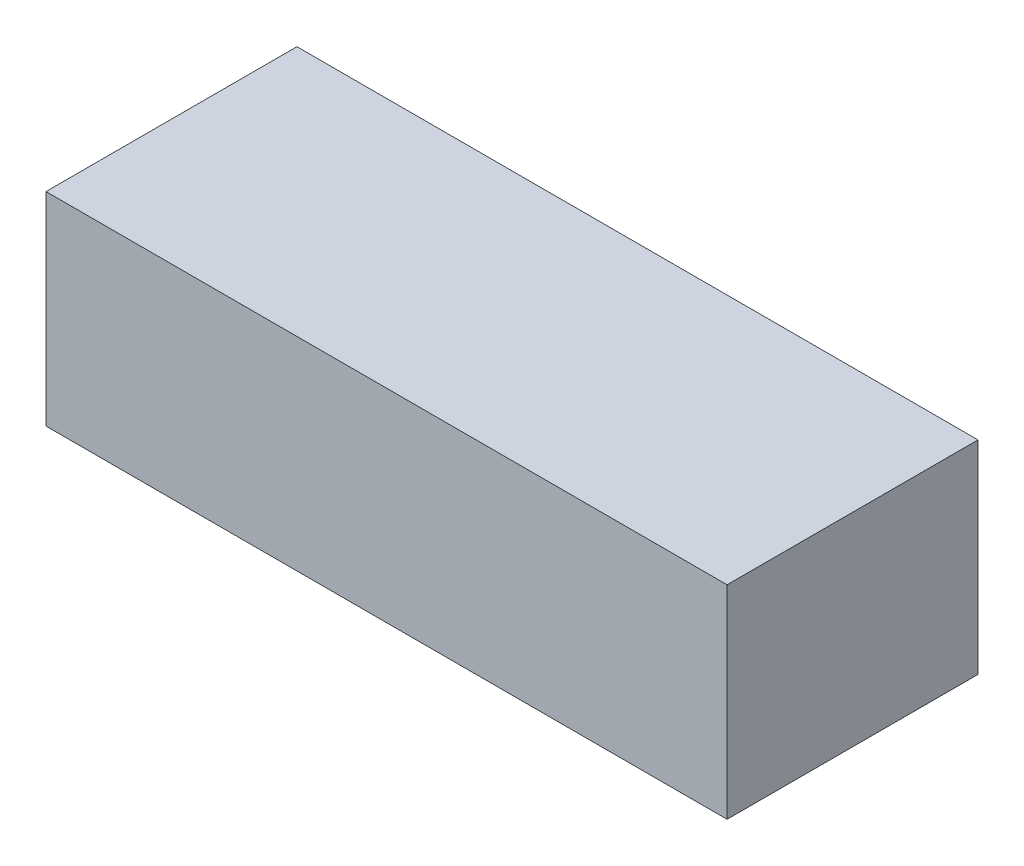
ISO-10303-21;
HEADER;
FILE_DESCRIPTION(('STEP AP214'),'2;1');
FILE_NAME('part.step','',(''),(''),'','','');
FILE_SCHEMA(('AUTOMOTIVE_DESIGN { 1 0 10303 214 1 1 1 1 }'));
ENDSEC;
DATA;
#1=APPLICATION_CONTEXT('core data for automotive mechanical design processes');
#2=APPLICATION_PROTOCOL_DEFINITION('international standard','automotive_design',2000,#1);
#3=PRODUCT_CONTEXT('',#1,'mechanical');
#4=PRODUCT('Part','Part','',(#3));
#5=PRODUCT_RELATED_PRODUCT_CATEGORY('part','',(#4));
#6=PRODUCT_DEFINITION_FORMATION('','',#4);
#7=PRODUCT_DEFINITION_CONTEXT('part definition',#1,'design');
#8=PRODUCT_DEFINITION('design','',#6,#7);
#9=PRODUCT_DEFINITION_SHAPE('','',#8);
#10=(LENGTH_UNIT() NAMED_UNIT(*) SI_UNIT(.MILLI.,.METRE.));
#11=(NAMED_UNIT(*) PLANE_ANGLE_UNIT() SI_UNIT($,.RADIAN.));
#12=(NAMED_UNIT(*) SI_UNIT($,.STERADIAN.) SOLID_ANGLE_UNIT());
#13=UNCERTAINTY_MEASURE_WITH_UNIT(LENGTH_MEASURE(1.E-05),#10,'distance_accuracy_value','');
#14=(GEOMETRIC_REPRESENTATION_CONTEXT(3) GLOBAL_UNCERTAINTY_ASSIGNED_CONTEXT((#13)) GLOBAL_UNIT_ASSIGNED_CONTEXT((#10,
#11,#12)) REPRESENTATION_CONTEXT('',''));
#15=CARTESIAN_POINT('',(0.,0.,0.));
#16=DIRECTION('',(0.,0.,1.));
#17=DIRECTION('',(1.,0.,0.));
#18=AXIS2_PLACEMENT_3D('',#15,#16,#17);
#19=CARTESIAN_POINT('',(0.,-8.00000037997961,0.));
#20=DIRECTION('',(0.,1.,0.));
#21=DIRECTION('',(0.,0.,1.));
#22=AXIS2_PLACEMENT_3D('',#19,#20,#21);
#23=PLANE('',#22);
#24=DIRECTION('',(0.,0.,1.));
#25=VECTOR('',#24,1.);
#26=CARTESIAN_POINT('',(45.0000017881393,-8.00000037997961,16.0000007599592));
#27=LINE('',#26,#25);
#28=CARTESIAN_POINT('',(45.0000017881393,-8.00000037997961,4.99999988824129));
#29=VERTEX_POINT('',#28);
#30=CARTESIAN_POINT('',(45.0000017881393,-8.00000037997961,16.0000007599592));
#31=VERTEX_POINT('',#30);
#32=EDGE_CURVE('E152',#29,#31,#27,.T.);
#33=ORIENTED_EDGE('',*,*,#32,.T.);
#34=DIRECTION('',(-1.,0.,0.));
#35=VECTOR('',#34,1.);
#36=CARTESIAN_POINT('',(-9.99999977648258,-8.00000037997961,16.0000007599592));
#37=LINE('',#36,#35);
#38=CARTESIAN_POINT('',(-9.99999977648258,-8.00000037997961,16.0000007599592));
#39=VERTEX_POINT('',#38);
#40=EDGE_CURVE('E155',#31,#39,#37,.T.);
#41=ORIENTED_EDGE('',*,*,#40,.T.);
#42=DIRECTION('',(0.,0.,-1.));
#43=VECTOR('',#42,1.);
#44=CARTESIAN_POINT('',(-9.99999977648258,-8.00000037997961,4.99999988824129));
#45=LINE('',#44,#43);
#46=CARTESIAN_POINT('',(-9.99999977648258,-8.00000037997961,4.99999988824129));
#47=VERTEX_POINT('',#46);
#48=EDGE_CURVE('E158',#39,#47,#45,.T.);
#49=ORIENTED_EDGE('',*,*,#48,.T.);
#50=DIRECTION('',(1.,0.,0.));
#51=VECTOR('',#50,1.);
#52=CARTESIAN_POINT('',(45.0000017881393,-8.00000037997961,4.99999988824129));
#53=LINE('',#52,#51);
#54=EDGE_CURVE('E160',#47,#29,#53,.T.);
#55=ORIENTED_EDGE('',*,*,#54,.T.);
#56=EDGE_LOOP('',(#33,#41,#49,#55));
#57=FACE_BOUND('',#56,.T.);
#58=DIRECTION('',(-1.,0.,0.));
#59=VECTOR('',#58,1.);
#60=CARTESIAN_POINT('',(-8.99999961256981,-8.00000037997961,13.0000002682209));
#61=LINE('',#60,#59);
#62=CARTESIAN_POINT('',(43.9999997615814,-8.00000037997961,13.0000002682209));
#63=VERTEX_POINT('',#62);
#64=CARTESIAN_POINT('',(-8.99999961256981,-8.00000037997961,13.0000002682209));
#65=VERTEX_POINT('',#64);
#66=EDGE_CURVE('E50',#63,#65,#61,.T.);
#67=ORIENTED_EDGE('',*,*,#66,.F.);
#68=DIRECTION('',(0.,0.,1.));
#69=VECTOR('',#68,1.);
#70=CARTESIAN_POINT('',(43.9999997615814,-8.00000037997961,13.0000002682209));
#71=LINE('',#70,#69);
#72=CARTESIAN_POINT('',(43.9999997615814,-8.00000037997961,9.99999977648258));
#73=VERTEX_POINT('',#72);
#74=EDGE_CURVE('E54',#73,#63,#71,.T.);
#75=ORIENTED_EDGE('',*,*,#74,.F.);
#76=DIRECTION('',(1.,0.,0.));
#77=VECTOR('',#76,1.);
#78=CARTESIAN_POINT('',(43.9999997615814,-8.00000037997961,9.99999977648258));
#79=LINE('',#78,#77);
#80=CARTESIAN_POINT('',(-8.99999961256981,-8.00000037997961,9.99999977648258));
#81=VERTEX_POINT('',#80);
#82=EDGE_CURVE('E368',#81,#73,#79,.T.);
#83=ORIENTED_EDGE('',*,*,#82,.F.);
#84=DIRECTION('',(0.,0.,-1.));
#85=VECTOR('',#84,1.);
#86=CARTESIAN_POINT('',(-8.99999961256981,-8.00000037997961,9.99999977648258));
#87=LINE('',#86,#85);
#88=EDGE_CURVE('E374',#65,#81,#87,.T.);
#89=ORIENTED_EDGE('',*,*,#88,.F.);
#90=EDGE_LOOP('',(#67,#75,#83,#89));
#91=FACE_BOUND('',#90,.T.);
#92=ADVANCED_FACE('F33',(#57,#91),#23,.F.);
#93=CARTESIAN_POINT('',(0.,-7.00000021606684,0.));
#94=DIRECTION('',(0.,1.,0.));
#95=DIRECTION('',(0.,0.,1.));
#96=AXIS2_PLACEMENT_3D('',#93,#94,#95);
#97=PLANE('',#96);
#98=DIRECTION('',(1.,0.,0.));
#99=VECTOR('',#98,1.);
#100=CARTESIAN_POINT('',(-10.9999999403954,-7.00000021606684,20.9999997168779));
#101=LINE('',#100,#99);
#102=CARTESIAN_POINT('',(-10.9999999403954,-7.00000021606684,20.9999997168779));
#103=VERTEX_POINT('',#102);
#104=CARTESIAN_POINT('',(46.000000089407,-7.00000021606684,20.9999997168779));
#105=VERTEX_POINT('',#104);
#106=EDGE_CURVE('E182',#103,#105,#101,.T.);
#107=ORIENTED_EDGE('',*,*,#106,.F.);
#108=DIRECTION('',(0.,0.,1.));
#109=VECTOR('',#108,1.);
#110=CARTESIAN_POINT('',(-10.9999999403954,-7.00000021606684,0.));
#111=LINE('',#110,#109);
#112=CARTESIAN_POINT('',(-10.9999999403954,-7.00000021606684,0.));
#113=VERTEX_POINT('',#112);
#114=EDGE_CURVE('E192',#113,#103,#111,.T.);
#115=ORIENTED_EDGE('',*,*,#114,.F.);
#116=DIRECTION('',(-1.,0.,0.));
#117=VECTOR('',#116,1.);
#118=CARTESIAN_POINT('',(46.000000089407,-7.00000021606684,0.));
#119=LINE('',#118,#117);
#120=CARTESIAN_POINT('',(46.000000089407,-7.00000021606684,0.));
#121=VERTEX_POINT('',#120);
#122=EDGE_CURVE('E189',#121,#113,#119,.T.);
#123=ORIENTED_EDGE('',*,*,#122,.F.);
#124=DIRECTION('',(0.,0.,-1.));
#125=VECTOR('',#124,1.);
#126=CARTESIAN_POINT('',(46.000000089407,-7.00000021606684,20.9999997168779));
#127=LINE('',#126,#125);
#128=EDGE_CURVE('E185',#105,#121,#127,.T.);
#129=ORIENTED_EDGE('',*,*,#128,.F.);
#130=EDGE_LOOP('',(#107,#115,#123,#129));
#131=FACE_BOUND('',#130,.T.);
#132=DIRECTION('',(0.,0.,1.));
#133=VECTOR('',#132,1.);
#134=CARTESIAN_POINT('',(45.0000017881393,-7.00000021606684,16.0000007599592));
#135=LINE('',#134,#133);
#136=CARTESIAN_POINT('',(45.0000017881393,-7.00000021606684,4.99999988824129));
#137=VERTEX_POINT('',#136);
#138=CARTESIAN_POINT('',(45.0000017881393,-7.00000021606684,16.0000007599592));
#139=VERTEX_POINT('',#138);
#140=EDGE_CURVE('E143',#137,#139,#135,.T.);
#141=ORIENTED_EDGE('',*,*,#140,.F.);
#142=DIRECTION('',(1.,0.,0.));
#143=VECTOR('',#142,1.);
#144=CARTESIAN_POINT('',(45.0000017881393,-7.00000021606684,4.99999988824129));
#145=LINE('',#144,#143);
#146=CARTESIAN_POINT('',(-9.99999977648258,-7.00000021606684,4.99999988824129));
#147=VERTEX_POINT('',#146);
#148=EDGE_CURVE('E156',#147,#137,#145,.T.);
#149=ORIENTED_EDGE('',*,*,#148,.F.);
#150=DIRECTION('',(0.,0.,-1.));
#151=VECTOR('',#150,1.);
#152=CARTESIAN_POINT('',(-9.99999977648258,-7.00000021606684,4.99999988824129));
#153=LINE('',#152,#151);
#154=CARTESIAN_POINT('',(-9.99999977648258,-7.00000021606684,16.0000007599592));
#155=VERTEX_POINT('',#154);
#156=EDGE_CURVE('E165',#155,#147,#153,.T.);
#157=ORIENTED_EDGE('',*,*,#156,.F.);
#158=DIRECTION('',(-1.,0.,0.));
#159=VECTOR('',#158,1.);
#160=CARTESIAN_POINT('',(-9.99999977648258,-7.00000021606684,16.0000007599592));
#161=LINE('',#160,#159);
#162=EDGE_CURVE('E146',#139,#155,#161,.T.);
#163=ORIENTED_EDGE('',*,*,#162,.F.);
#164=EDGE_LOOP('',(#141,#149,#157,#163));
#165=FACE_BOUND('',#164,.T.);
#166=ADVANCED_FACE('F221',(#131,#165),#97,.F.);
#167=CARTESIAN_POINT('',(-10.9999999403954,-7.00000021606684,20.9999997168779));
#168=DIRECTION('',(0.,0.,1.));
#169=DIRECTION('',(1.,0.,0.));
#170=AXIS2_PLACEMENT_3D('',#167,#168,#169);
#171=PLANE('',#170);
#172=DIRECTION('',(1.,0.,0.));
#173=VECTOR('',#172,1.);
#174=CARTESIAN_POINT('',(-10.9999999403954,9.99999977648258,20.9999997168779));
#175=LINE('',#174,#173);
#176=CARTESIAN_POINT('',(-10.9999999403954,9.99999977648258,20.9999997168779));
#177=VERTEX_POINT('',#176);
#178=CARTESIAN_POINT('',(46.000000089407,9.99999977648258,20.9999997168779));
#179=VERTEX_POINT('',#178);
#180=EDGE_CURVE('E181',#177,#179,#175,.T.);
#181=ORIENTED_EDGE('',*,*,#180,.F.);
#182=DIRECTION('',(0.,1.,0.));
#183=VECTOR('',#182,1.);
#184=CARTESIAN_POINT('',(-10.9999999403954,-7.00000021606684,20.9999997168779));
#185=LINE('',#184,#183);
#186=EDGE_CURVE('E11',#103,#177,#185,.T.);
#187=ORIENTED_EDGE('',*,*,#186,.F.);
#188=ORIENTED_EDGE('',*,*,#106,.T.);
#189=DIRECTION('',(0.,1.,0.));
#190=VECTOR('',#189,1.);
#191=CARTESIAN_POINT('',(46.000000089407,-7.00000021606684,20.9999997168779));
#192=LINE('',#191,#190);
#193=EDGE_CURVE('E37',#105,#179,#192,.T.);
#194=ORIENTED_EDGE('',*,*,#193,.T.);
#195=EDGE_LOOP('',(#181,#187,#188,#194));
#196=FACE_BOUND('',#195,.T.);
#197=ADVANCED_FACE('F35',(#196),#171,.T.);
#198=CARTESIAN_POINT('',(-10.9999999403954,-7.00000021606684,0.));
#199=DIRECTION('',(-1.,0.,0.));
#200=DIRECTION('',(0.,0.,1.));
#201=AXIS2_PLACEMENT_3D('',#198,#199,#200);
#202=PLANE('',#201);
#203=DIRECTION('',(0.,0.,1.));
#204=VECTOR('',#203,1.);
#205=CARTESIAN_POINT('',(-10.9999999403954,9.99999977648258,0.));
#206=LINE('',#205,#204);
#207=CARTESIAN_POINT('',(-10.9999999403954,9.99999977648258,0.));
#208=VERTEX_POINT('',#207);
#209=EDGE_CURVE('E186',#208,#177,#206,.T.);
#210=ORIENTED_EDGE('',*,*,#209,.F.);
#211=DIRECTION('',(0.,1.,0.));
#212=VECTOR('',#211,1.);
#213=CARTESIAN_POINT('',(-10.9999999403954,-7.00000021606684,0.));
#214=LINE('',#213,#212);
#215=EDGE_CURVE('E42',#113,#208,#214,.T.);
#216=ORIENTED_EDGE('',*,*,#215,.F.);
#217=ORIENTED_EDGE('',*,*,#114,.T.);
#218=ORIENTED_EDGE('',*,*,#186,.T.);
#219=EDGE_LOOP('',(#210,#216,#217,#218));
#220=FACE_BOUND('',#219,.T.);
#221=ADVANCED_FACE('F218',(#220),#202,.T.);
#222=CARTESIAN_POINT('',(46.000000089407,-7.00000021606684,0.));
#223=DIRECTION('',(0.,0.,-1.));
#224=DIRECTION('',(-1.,0.,0.));
#225=AXIS2_PLACEMENT_3D('',#222,#223,#224);
#226=PLANE('',#225);
#227=DIRECTION('',(-1.,0.,0.));
#228=VECTOR('',#227,1.);
#229=CARTESIAN_POINT('',(46.000000089407,9.99999977648258,0.));
#230=LINE('',#229,#228);
#231=CARTESIAN_POINT('',(46.000000089407,9.99999977648258,0.));
#232=VERTEX_POINT('',#231);
#233=EDGE_CURVE('E200',#232,#208,#230,.T.);
#234=ORIENTED_EDGE('',*,*,#233,.F.);
#235=DIRECTION('',(0.,1.,0.));
#236=VECTOR('',#235,1.);
#237=CARTESIAN_POINT('',(46.000000089407,-7.00000021606684,0.));
#238=LINE('',#237,#236);
#239=EDGE_CURVE('E205',#121,#232,#238,.T.);
#240=ORIENTED_EDGE('',*,*,#239,.F.);
#241=ORIENTED_EDGE('',*,*,#122,.T.);
#242=ORIENTED_EDGE('',*,*,#215,.T.);
#243=EDGE_LOOP('',(#234,#240,#241,#242));
#244=FACE_BOUND('',#243,.T.);
#245=ADVANCED_FACE('F225',(#244),#226,.T.);
#246=CARTESIAN_POINT('',(46.000000089407,-7.00000021606684,20.9999997168779));
#247=DIRECTION('',(1.,0.,0.));
#248=DIRECTION('',(0.,0.,-1.));
#249=AXIS2_PLACEMENT_3D('',#246,#247,#248);
#250=PLANE('',#249);
#251=DIRECTION('',(0.,0.,-1.));
#252=VECTOR('',#251,1.);
#253=CARTESIAN_POINT('',(46.000000089407,9.99999977648258,20.9999997168779));
#254=LINE('',#253,#252);
#255=EDGE_CURVE('E197',#179,#232,#254,.T.);
#256=ORIENTED_EDGE('',*,*,#255,.F.);
#257=ORIENTED_EDGE('',*,*,#193,.F.);
#258=ORIENTED_EDGE('',*,*,#128,.T.);
#259=ORIENTED_EDGE('',*,*,#239,.T.);
#260=EDGE_LOOP('',(#256,#257,#258,#259));
#261=FACE_BOUND('',#260,.T.);
#262=ADVANCED_FACE('F213',(#261),#250,.T.);
#263=CARTESIAN_POINT('',(0.,9.99999977648258,0.));
#264=DIRECTION('',(0.,1.,0.));
#265=DIRECTION('',(0.,0.,1.));
#266=AXIS2_PLACEMENT_3D('',#263,#264,#265);
#267=PLANE('',#266);
#268=ORIENTED_EDGE('',*,*,#180,.T.);
#269=ORIENTED_EDGE('',*,*,#255,.T.);
#270=ORIENTED_EDGE('',*,*,#233,.T.);
#271=ORIENTED_EDGE('',*,*,#209,.T.);
#272=EDGE_LOOP('',(#268,#269,#270,#271));
#273=FACE_BOUND('',#272,.T.);
#274=ADVANCED_FACE('F215',(#273),#267,.T.);
#275=CARTESIAN_POINT('',(45.0000017881393,-8.00000037997961,16.0000007599592));
#276=DIRECTION('',(-1.,0.,0.));
#277=DIRECTION('',(0.,0.,1.));
#278=AXIS2_PLACEMENT_3D('',#275,#276,#277);
#279=PLANE('',#278);
#280=ORIENTED_EDGE('',*,*,#140,.T.);
#281=DIRECTION('',(0.,1.,0.));
#282=VECTOR('',#281,1.);
#283=CARTESIAN_POINT('',(45.0000017881393,-8.00000037997961,16.0000007599592));
#284=LINE('',#283,#282);
#285=EDGE_CURVE('E178',#31,#139,#284,.T.);
#286=ORIENTED_EDGE('',*,*,#285,.F.);
#287=ORIENTED_EDGE('',*,*,#32,.F.);
#288=DIRECTION('',(0.,1.,0.));
#289=VECTOR('',#288,1.);
#290=CARTESIAN_POINT('',(45.0000017881393,-8.00000037997961,4.99999988824129));
#291=LINE('',#290,#289);
#292=EDGE_CURVE('E161',#29,#137,#291,.T.);
#293=ORIENTED_EDGE('',*,*,#292,.T.);
#294=EDGE_LOOP('',(#280,#286,#287,#293));
#295=FACE_BOUND('',#294,.T.);
#296=ADVANCED_FACE('F254',(#295),#279,.F.);
#297=CARTESIAN_POINT('',(-9.99999977648258,-8.00000037997961,16.0000007599592));
#298=DIRECTION('',(0.,0.,-1.));
#299=DIRECTION('',(-1.,0.,0.));
#300=AXIS2_PLACEMENT_3D('',#297,#298,#299);
#301=PLANE('',#300);
#302=ORIENTED_EDGE('',*,*,#162,.T.);
#303=DIRECTION('',(0.,1.,0.));
#304=VECTOR('',#303,1.);
#305=CARTESIAN_POINT('',(-9.99999977648258,-8.00000037997961,16.0000007599592));
#306=LINE('',#305,#304);
#307=EDGE_CURVE('E175',#39,#155,#306,.T.);
#308=ORIENTED_EDGE('',*,*,#307,.F.);
#309=ORIENTED_EDGE('',*,*,#40,.F.);
#310=ORIENTED_EDGE('',*,*,#285,.T.);
#311=EDGE_LOOP('',(#302,#308,#309,#310));
#312=FACE_BOUND('',#311,.T.);
#313=ADVANCED_FACE('F250',(#312),#301,.F.);
#314=CARTESIAN_POINT('',(-9.99999977648258,-8.00000037997961,4.99999988824129));
#315=DIRECTION('',(1.,0.,0.));
#316=DIRECTION('',(0.,0.,-1.));
#317=AXIS2_PLACEMENT_3D('',#314,#315,#316);
#318=PLANE('',#317);
#319=ORIENTED_EDGE('',*,*,#156,.T.);
#320=DIRECTION('',(0.,1.,0.));
#321=VECTOR('',#320,1.);
#322=CARTESIAN_POINT('',(-9.99999977648258,-8.00000037997961,4.99999988824129));
#323=LINE('',#322,#321);
#324=EDGE_CURVE('E172',#47,#147,#323,.T.);
#325=ORIENTED_EDGE('',*,*,#324,.F.);
#326=ORIENTED_EDGE('',*,*,#48,.F.);
#327=ORIENTED_EDGE('',*,*,#307,.T.);
#328=EDGE_LOOP('',(#319,#325,#326,#327));
#329=FACE_BOUND('',#328,.T.);
#330=ADVANCED_FACE('F246',(#329),#318,.F.);
#331=CARTESIAN_POINT('',(45.0000017881393,-8.00000037997961,4.99999988824129));
#332=DIRECTION('',(0.,0.,1.));
#333=DIRECTION('',(1.,0.,0.));
#334=AXIS2_PLACEMENT_3D('',#331,#332,#333);
#335=PLANE('',#334);
#336=ORIENTED_EDGE('',*,*,#148,.T.);
#337=ORIENTED_EDGE('',*,*,#292,.F.);
#338=ORIENTED_EDGE('',*,*,#54,.F.);
#339=ORIENTED_EDGE('',*,*,#324,.T.);
#340=EDGE_LOOP('',(#336,#337,#338,#339));
#341=FACE_BOUND('',#340,.T.);
#342=ADVANCED_FACE('F243',(#341),#335,.F.);
#343=CARTESIAN_POINT('',(-8.99999961256981,-8.99999961256981,13.0000002682209));
#344=DIRECTION('',(0.,0.,-1.));
#345=DIRECTION('',(-1.,0.,0.));
#346=AXIS2_PLACEMENT_3D('',#343,#344,#345);
#347=PLANE('',#346);
#348=ORIENTED_EDGE('',*,*,#66,.T.);
#349=DIRECTION('',(0.,1.,0.));
#350=VECTOR('',#349,1.);
#351=CARTESIAN_POINT('',(-8.99999961256981,-8.99999961256981,13.0000002682209));
#352=LINE('',#351,#350);
#353=CARTESIAN_POINT('',(-8.99999961256981,-8.99999961256981,13.0000002682209));
#354=VERTEX_POINT('',#353);
#355=EDGE_CURVE('E126',#354,#65,#352,.T.);
#356=ORIENTED_EDGE('',*,*,#355,.F.);
#357=DIRECTION('',(-1.,0.,0.));
#358=VECTOR('',#357,1.);
#359=CARTESIAN_POINT('',(-8.99999961256981,-8.99999961256981,13.0000002682209));
#360=LINE('',#359,#358);
#361=CARTESIAN_POINT('',(43.9999997615814,-8.99999961256981,13.0000002682209));
#362=VERTEX_POINT('',#361);
#363=EDGE_CURVE('E132',#362,#354,#360,.T.);
#364=ORIENTED_EDGE('',*,*,#363,.F.);
#365=DIRECTION('',(0.,1.,0.));
#366=VECTOR('',#365,1.);
#367=CARTESIAN_POINT('',(43.9999997615814,-8.99999961256981,13.0000002682209));
#368=LINE('',#367,#366);
#369=EDGE_CURVE('E366',#362,#63,#368,.T.);
#370=ORIENTED_EDGE('',*,*,#369,.T.);
#371=EDGE_LOOP('',(#348,#356,#364,#370));
#372=FACE_BOUND('',#371,.T.);
#373=ADVANCED_FACE('F142',(#372),#347,.F.);
#374=CARTESIAN_POINT('',(-8.99999961256981,-8.99999961256981,9.99999977648258));
#375=DIRECTION('',(1.,0.,0.));
#376=DIRECTION('',(0.,0.,-1.));
#377=AXIS2_PLACEMENT_3D('',#374,#375,#376);
#378=PLANE('',#377);
#379=ORIENTED_EDGE('',*,*,#88,.T.);
#380=DIRECTION('',(0.,1.,0.));
#381=VECTOR('',#380,1.);
#382=CARTESIAN_POINT('',(-8.99999961256981,-8.99999961256981,9.99999977648258));
#383=LINE('',#382,#381);
#384=CARTESIAN_POINT('',(-8.99999961256981,-8.99999961256981,9.99999977648258));
#385=VERTEX_POINT('',#384);
#386=EDGE_CURVE('E128',#385,#81,#383,.T.);
#387=ORIENTED_EDGE('',*,*,#386,.F.);
#388=DIRECTION('',(0.,0.,-1.));
#389=VECTOR('',#388,1.);
#390=CARTESIAN_POINT('',(-8.99999961256981,-8.99999961256981,9.99999977648258));
#391=LINE('',#390,#389);
#392=EDGE_CURVE('E121',#354,#385,#391,.T.);
#393=ORIENTED_EDGE('',*,*,#392,.F.);
#394=ORIENTED_EDGE('',*,*,#355,.T.);
#395=EDGE_LOOP('',(#379,#387,#393,#394));
#396=FACE_BOUND('',#395,.T.);
#397=ADVANCED_FACE('F124',(#396),#378,.F.);
#398=CARTESIAN_POINT('',(43.9999997615814,-8.99999961256981,9.99999977648258));
#399=DIRECTION('',(0.,0.,1.));
#400=DIRECTION('',(1.,0.,0.));
#401=AXIS2_PLACEMENT_3D('',#398,#399,#400);
#402=PLANE('',#401);
#403=ORIENTED_EDGE('',*,*,#82,.T.);
#404=DIRECTION('',(0.,1.,0.));
#405=VECTOR('',#404,1.);
#406=CARTESIAN_POINT('',(43.9999997615814,-8.99999961256981,9.99999977648258));
#407=LINE('',#406,#405);
#408=CARTESIAN_POINT('',(43.9999997615814,-8.99999961256981,9.99999977648258));
#409=VERTEX_POINT('',#408);
#410=EDGE_CURVE('E148',#409,#73,#407,.T.);
#411=ORIENTED_EDGE('',*,*,#410,.F.);
#412=DIRECTION('',(1.,0.,0.));
#413=VECTOR('',#412,1.);
#414=CARTESIAN_POINT('',(43.9999997615814,-8.99999961256981,9.99999977648258));
#415=LINE('',#414,#413);
#416=EDGE_CURVE('E131',#385,#409,#415,.T.);
#417=ORIENTED_EDGE('',*,*,#416,.F.);
#418=ORIENTED_EDGE('',*,*,#386,.T.);
#419=EDGE_LOOP('',(#403,#411,#417,#418));
#420=FACE_BOUND('',#419,.T.);
#421=ADVANCED_FACE('F292',(#420),#402,.F.);
#422=CARTESIAN_POINT('',(43.9999997615814,-8.99999961256981,13.0000002682209));
#423=DIRECTION('',(-1.,0.,0.));
#424=DIRECTION('',(0.,0.,1.));
#425=AXIS2_PLACEMENT_3D('',#422,#423,#424);
#426=PLANE('',#425);
#427=ORIENTED_EDGE('',*,*,#74,.T.);
#428=ORIENTED_EDGE('',*,*,#369,.F.);
#429=DIRECTION('',(0.,0.,1.));
#430=VECTOR('',#429,1.);
#431=CARTESIAN_POINT('',(43.9999997615814,-8.99999961256981,13.0000002682209));
#432=LINE('',#431,#430);
#433=EDGE_CURVE('E137',#409,#362,#432,.T.);
#434=ORIENTED_EDGE('',*,*,#433,.F.);
#435=ORIENTED_EDGE('',*,*,#410,.T.);
#436=EDGE_LOOP('',(#427,#428,#434,#435));
#437=FACE_BOUND('',#436,.T.);
#438=ADVANCED_FACE('F298',(#437),#426,.F.);
#439=CARTESIAN_POINT('',(0.,-8.99999961256981,0.));
#440=DIRECTION('',(0.,1.,0.));
#441=DIRECTION('',(0.,0.,1.));
#442=AXIS2_PLACEMENT_3D('',#439,#440,#441);
#443=PLANE('',#442);
#444=ORIENTED_EDGE('',*,*,#363,.T.);
#445=ORIENTED_EDGE('',*,*,#392,.T.);
#446=ORIENTED_EDGE('',*,*,#416,.T.);
#447=ORIENTED_EDGE('',*,*,#433,.T.);
#448=EDGE_LOOP('',(#444,#445,#446,#447));
#449=FACE_BOUND('',#448,.T.);
#450=ADVANCED_FACE('F135',(#449),#443,.F.);
#451=CLOSED_SHELL('',(#92,#166,#197,#221,#245,#262,#274,#296,#313,#330,#342,#373,#397,#421,#438,#450));
#452=MANIFOLD_SOLID_BREP('B2',#451);
#453=ADVANCED_BREP_SHAPE_REPRESENTATION('',(#18,#452),#14);
#454=SHAPE_DEFINITION_REPRESENTATION(#9,#453);
ENDSEC;
END-ISO-10303-21;
